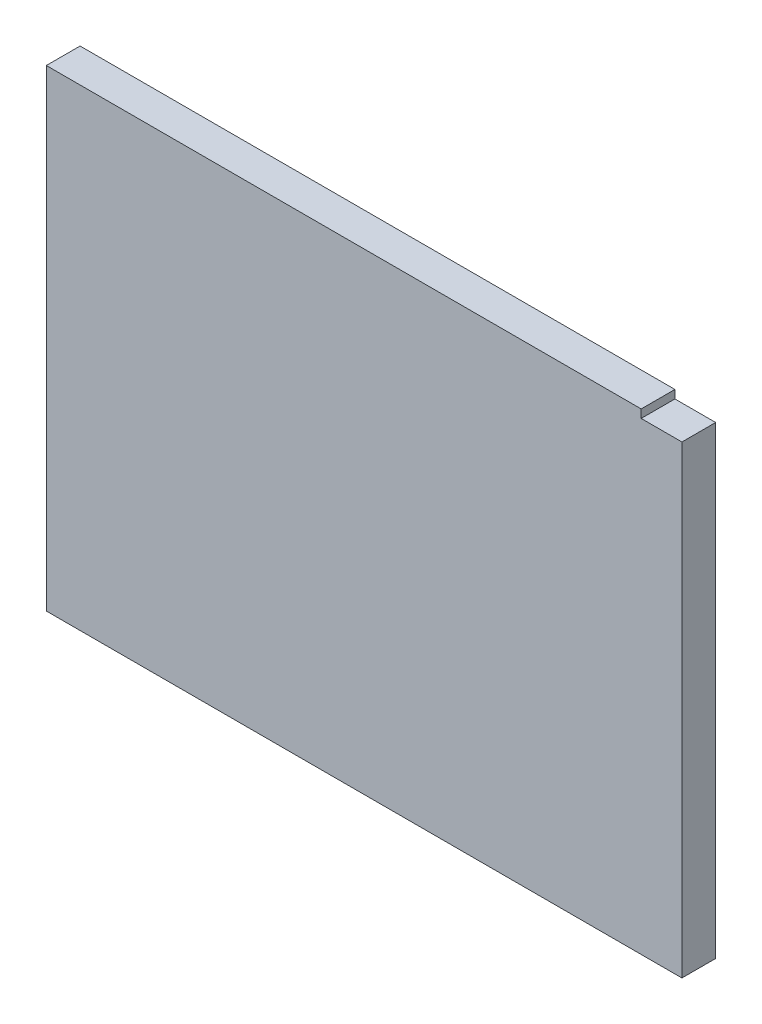
ISO-10303-21;
HEADER;
FILE_DESCRIPTION(('STEP AP214'),'2;1');
FILE_NAME('part.step','',(''),(''),'','','');
FILE_SCHEMA(('AUTOMOTIVE_DESIGN { 1 0 10303 214 1 1 1 1 }'));
ENDSEC;
DATA;
#1=APPLICATION_CONTEXT('core data for automotive mechanical design processes');
#2=APPLICATION_PROTOCOL_DEFINITION('international standard','automotive_design',2000,#1);
#3=PRODUCT_CONTEXT('',#1,'mechanical');
#4=PRODUCT('Part','Part','',(#3));
#5=PRODUCT_RELATED_PRODUCT_CATEGORY('part','',(#4));
#6=PRODUCT_DEFINITION_FORMATION('','',#4);
#7=PRODUCT_DEFINITION_CONTEXT('part definition',#1,'design');
#8=PRODUCT_DEFINITION('design','',#6,#7);
#9=PRODUCT_DEFINITION_SHAPE('','',#8);
#10=(LENGTH_UNIT() NAMED_UNIT(*) SI_UNIT(.MILLI.,.METRE.));
#11=(NAMED_UNIT(*) PLANE_ANGLE_UNIT() SI_UNIT($,.RADIAN.));
#12=(NAMED_UNIT(*) SI_UNIT($,.STERADIAN.) SOLID_ANGLE_UNIT());
#13=UNCERTAINTY_MEASURE_WITH_UNIT(LENGTH_MEASURE(1.E-05),#10,'distance_accuracy_value','');
#14=(GEOMETRIC_REPRESENTATION_CONTEXT(3) GLOBAL_UNCERTAINTY_ASSIGNED_CONTEXT((#13)) GLOBAL_UNIT_ASSIGNED_CONTEXT((#10,
#11,#12)) REPRESENTATION_CONTEXT('',''));
#15=CARTESIAN_POINT('',(0.,0.,0.));
#16=DIRECTION('',(0.,0.,1.));
#17=DIRECTION('',(1.,0.,0.));
#18=AXIS2_PLACEMENT_3D('',#15,#16,#17);
#19=CARTESIAN_POINT('',(-4978.4,1379.22,-11.43));
#20=DIRECTION('',(0.,1.,0.));
#21=DIRECTION('',(0.,0.,1.));
#22=AXIS2_PLACEMENT_3D('',#19,#20,#21);
#23=PLANE('',#22);
#24=DIRECTION('',(0.,0.,-1.));
#25=VECTOR('',#24,1.);
#26=CARTESIAN_POINT('',(-4776.93355,1379.22,14.0785801167062));
#27=LINE('',#26,#25);
#28=CARTESIAN_POINT('',(-4776.93355,1379.22,0.));
#29=VERTEX_POINT('',#28);
#30=CARTESIAN_POINT('',(-4776.93355,1379.22,-11.43));
#31=VERTEX_POINT('',#30);
#32=EDGE_CURVE('E47',#29,#31,#27,.T.);
#33=ORIENTED_EDGE('',*,*,#32,.T.);
#34=DIRECTION('',(-1.,0.,0.));
#35=VECTOR('',#34,1.);
#36=CARTESIAN_POINT('',(-4978.4,1379.22,-11.43));
#37=LINE('',#36,#35);
#38=CARTESIAN_POINT('',(-4978.4,1379.22,-11.43));
#39=VERTEX_POINT('',#38);
#40=EDGE_CURVE('E75',#31,#39,#37,.T.);
#41=ORIENTED_EDGE('',*,*,#40,.T.);
#42=DIRECTION('',(0.,0.,1.));
#43=VECTOR('',#42,1.);
#44=CARTESIAN_POINT('',(-4978.4,1379.22,-11.43));
#45=LINE('',#44,#43);
#46=CARTESIAN_POINT('',(-4978.4,1379.22,0.));
#47=VERTEX_POINT('',#46);
#48=EDGE_CURVE('E34',#39,#47,#45,.T.);
#49=ORIENTED_EDGE('',*,*,#48,.T.);
#50=DIRECTION('',(-1.,0.,0.));
#51=VECTOR('',#50,1.);
#52=CARTESIAN_POINT('',(-4978.4,1379.22,0.));
#53=LINE('',#52,#51);
#54=EDGE_CURVE('E116',#29,#47,#53,.T.);
#55=ORIENTED_EDGE('',*,*,#54,.F.);
#56=EDGE_LOOP('',(#33,#41,#49,#55));
#57=FACE_BOUND('',#56,.T.);
#58=ADVANCED_FACE('F31',(#57),#23,.T.);
#59=CARTESIAN_POINT('',(-4763.135,1379.22,-11.43));
#60=DIRECTION('',(1.,0.,0.));
#61=DIRECTION('',(0.,0.,-1.));
#62=AXIS2_PLACEMENT_3D('',#59,#60,#61);
#63=PLANE('',#62);
#64=DIRECTION('',(0.,0.,-1.));
#65=VECTOR('',#64,1.);
#66=CARTESIAN_POINT('',(-4763.135,1376.426,14.0785801167062));
#67=LINE('',#66,#65);
#68=CARTESIAN_POINT('',(-4763.135,1376.426,0.));
#69=VERTEX_POINT('',#68);
#70=CARTESIAN_POINT('',(-4763.135,1376.426,-11.43));
#71=VERTEX_POINT('',#70);
#72=EDGE_CURVE('E103',#69,#71,#67,.T.);
#73=ORIENTED_EDGE('',*,*,#72,.F.);
#74=DIRECTION('',(0.,1.,0.));
#75=VECTOR('',#74,1.);
#76=CARTESIAN_POINT('',(-4763.135,1379.22,0.));
#77=LINE('',#76,#75);
#78=CARTESIAN_POINT('',(-4763.135,1219.2,0.));
#79=VERTEX_POINT('',#78);
#80=EDGE_CURVE('E119',#79,#69,#77,.T.);
#81=ORIENTED_EDGE('',*,*,#80,.F.);
#82=DIRECTION('',(0.,0.,1.));
#83=VECTOR('',#82,1.);
#84=CARTESIAN_POINT('',(-4763.135,1219.2,-11.43));
#85=LINE('',#84,#83);
#86=CARTESIAN_POINT('',(-4763.135,1219.2,-11.43));
#87=VERTEX_POINT('',#86);
#88=EDGE_CURVE('E11',#87,#79,#85,.T.);
#89=ORIENTED_EDGE('',*,*,#88,.F.);
#90=DIRECTION('',(0.,1.,0.));
#91=VECTOR('',#90,1.);
#92=CARTESIAN_POINT('',(-4763.135,1379.22,-11.43));
#93=LINE('',#92,#91);
#94=EDGE_CURVE('E124',#87,#71,#93,.T.);
#95=ORIENTED_EDGE('',*,*,#94,.T.);
#96=EDGE_LOOP('',(#73,#81,#89,#95));
#97=FACE_BOUND('',#96,.T.);
#98=ADVANCED_FACE('F139',(#97),#63,.T.);
#99=CARTESIAN_POINT('',(-4763.135,1219.2,-11.43));
#100=DIRECTION('',(0.,-1.,0.));
#101=DIRECTION('',(1.,0.,0.));
#102=AXIS2_PLACEMENT_3D('',#99,#100,#101);
#103=PLANE('',#102);
#104=DIRECTION('',(1.,0.,0.));
#105=VECTOR('',#104,1.);
#106=CARTESIAN_POINT('',(-4763.135,1219.2,0.));
#107=LINE('',#106,#105);
#108=CARTESIAN_POINT('',(-4978.4,1219.2,0.));
#109=VERTEX_POINT('',#108);
#110=EDGE_CURVE('E130',#109,#79,#107,.T.);
#111=ORIENTED_EDGE('',*,*,#110,.F.);
#112=DIRECTION('',(0.,0.,1.));
#113=VECTOR('',#112,1.);
#114=CARTESIAN_POINT('',(-4978.4,1219.2,-11.43));
#115=LINE('',#114,#113);
#116=CARTESIAN_POINT('',(-4978.4,1219.2,-11.43));
#117=VERTEX_POINT('',#116);
#118=EDGE_CURVE('E39',#117,#109,#115,.T.);
#119=ORIENTED_EDGE('',*,*,#118,.F.);
#120=DIRECTION('',(1.,0.,0.));
#121=VECTOR('',#120,1.);
#122=CARTESIAN_POINT('',(-4763.135,1219.2,-11.43));
#123=LINE('',#122,#121);
#124=EDGE_CURVE('E122',#117,#87,#123,.T.);
#125=ORIENTED_EDGE('',*,*,#124,.T.);
#126=ORIENTED_EDGE('',*,*,#88,.T.);
#127=EDGE_LOOP('',(#111,#119,#125,#126));
#128=FACE_BOUND('',#127,.T.);
#129=ADVANCED_FACE('F141',(#128),#103,.T.);
#130=CARTESIAN_POINT('',(-4978.4,1219.2,-11.43));
#131=DIRECTION('',(-1.,0.,0.));
#132=DIRECTION('',(0.,0.,1.));
#133=AXIS2_PLACEMENT_3D('',#130,#131,#132);
#134=PLANE('',#133);
#135=DIRECTION('',(0.,-1.,0.));
#136=VECTOR('',#135,1.);
#137=CARTESIAN_POINT('',(-4978.4,1219.2,0.));
#138=LINE('',#137,#136);
#139=EDGE_CURVE('E127',#47,#109,#138,.T.);
#140=ORIENTED_EDGE('',*,*,#139,.F.);
#141=ORIENTED_EDGE('',*,*,#48,.F.);
#142=DIRECTION('',(0.,-1.,0.));
#143=VECTOR('',#142,1.);
#144=CARTESIAN_POINT('',(-4978.4,1219.2,-11.43));
#145=LINE('',#144,#143);
#146=EDGE_CURVE('E118',#39,#117,#145,.T.);
#147=ORIENTED_EDGE('',*,*,#146,.T.);
#148=ORIENTED_EDGE('',*,*,#118,.T.);
#149=EDGE_LOOP('',(#140,#141,#147,#148));
#150=FACE_BOUND('',#149,.T.);
#151=ADVANCED_FACE('F136',(#150),#134,.T.);
#152=CARTESIAN_POINT('',(-4763.135,1379.22,-11.43));
#153=DIRECTION('',(0.,0.,-1.));
#154=DIRECTION('',(-1.,0.,0.));
#155=AXIS2_PLACEMENT_3D('',#152,#153,#154);
#156=PLANE('',#155);
#157=DIRECTION('',(-1.,0.,0.));
#158=VECTOR('',#157,1.);
#159=CARTESIAN_POINT('',(-4763.135,1376.426,-11.43));
#160=LINE('',#159,#158);
#161=CARTESIAN_POINT('',(-4776.93355,1376.426,-11.43));
#162=VERTEX_POINT('',#161);
#163=EDGE_CURVE('E100',#71,#162,#160,.T.);
#164=ORIENTED_EDGE('',*,*,#163,.F.);
#165=ORIENTED_EDGE('',*,*,#94,.F.);
#166=ORIENTED_EDGE('',*,*,#124,.F.);
#167=ORIENTED_EDGE('',*,*,#146,.F.);
#168=ORIENTED_EDGE('',*,*,#40,.F.);
#169=DIRECTION('',(0.,1.,0.));
#170=VECTOR('',#169,1.);
#171=CARTESIAN_POINT('',(-4776.93355,1376.426,-11.43));
#172=LINE('',#171,#170);
#173=EDGE_CURVE('E94',#162,#31,#172,.T.);
#174=ORIENTED_EDGE('',*,*,#173,.F.);
#175=EDGE_LOOP('',(#164,#165,#166,#167,#168,#174));
#176=FACE_BOUND('',#175,.T.);
#177=ADVANCED_FACE('F107',(#176),#156,.T.);
#178=CARTESIAN_POINT('',(-4763.135,1379.22,0.));
#179=DIRECTION('',(0.,0.,-1.));
#180=DIRECTION('',(-1.,0.,0.));
#181=AXIS2_PLACEMENT_3D('',#178,#179,#180);
#182=PLANE('',#181);
#183=ORIENTED_EDGE('',*,*,#80,.T.);
#184=DIRECTION('',(1.,0.,0.));
#185=VECTOR('',#184,1.);
#186=CARTESIAN_POINT('',(-4763.135,1376.426,0.));
#187=LINE('',#186,#185);
#188=CARTESIAN_POINT('',(-4776.93355,1376.426,0.));
#189=VERTEX_POINT('',#188);
#190=EDGE_CURVE('E113',#189,#69,#187,.T.);
#191=ORIENTED_EDGE('',*,*,#190,.F.);
#192=DIRECTION('',(0.,-1.,0.));
#193=VECTOR('',#192,1.);
#194=CARTESIAN_POINT('',(-4776.93355,1376.426,0.));
#195=LINE('',#194,#193);
#196=EDGE_CURVE('E95',#29,#189,#195,.T.);
#197=ORIENTED_EDGE('',*,*,#196,.F.);
#198=ORIENTED_EDGE('',*,*,#54,.T.);
#199=ORIENTED_EDGE('',*,*,#139,.T.);
#200=ORIENTED_EDGE('',*,*,#110,.T.);
#201=EDGE_LOOP('',(#183,#191,#197,#198,#199,#200));
#202=FACE_BOUND('',#201,.T.);
#203=ADVANCED_FACE('F138',(#202),#182,.F.);
#204=CARTESIAN_POINT('',(-4763.135,1376.426,14.0785801167062));
#205=DIRECTION('',(0.,-1.,0.));
#206=DIRECTION('',(0.,0.,-1.));
#207=AXIS2_PLACEMENT_3D('',#204,#205,#206);
#208=PLANE('',#207);
#209=ORIENTED_EDGE('',*,*,#190,.T.);
#210=ORIENTED_EDGE('',*,*,#72,.T.);
#211=ORIENTED_EDGE('',*,*,#163,.T.);
#212=DIRECTION('',(0.,0.,-1.));
#213=VECTOR('',#212,1.);
#214=CARTESIAN_POINT('',(-4776.93355,1376.426,14.0785801167062));
#215=LINE('',#214,#213);
#216=EDGE_CURVE('E90',#189,#162,#215,.T.);
#217=ORIENTED_EDGE('',*,*,#216,.F.);
#218=EDGE_LOOP('',(#209,#210,#211,#217));
#219=FACE_BOUND('',#218,.T.);
#220=ADVANCED_FACE('F101',(#219),#208,.F.);
#221=CARTESIAN_POINT('',(-4776.93355,1376.426,14.0785801167062));
#222=DIRECTION('',(-1.,0.,0.));
#223=DIRECTION('',(0.,0.,1.));
#224=AXIS2_PLACEMENT_3D('',#221,#222,#223);
#225=PLANE('',#224);
#226=ORIENTED_EDGE('',*,*,#196,.T.);
#227=ORIENTED_EDGE('',*,*,#216,.T.);
#228=ORIENTED_EDGE('',*,*,#173,.T.);
#229=ORIENTED_EDGE('',*,*,#32,.F.);
#230=EDGE_LOOP('',(#226,#227,#228,#229));
#231=FACE_BOUND('',#230,.T.);
#232=ADVANCED_FACE('F92',(#231),#225,.F.);
#233=CLOSED_SHELL('',(#58,#98,#129,#151,#177,#203,#220,#232));
#234=MANIFOLD_SOLID_BREP('B2',#233);
#235=ADVANCED_BREP_SHAPE_REPRESENTATION('',(#18,#234),#14);
#236=SHAPE_DEFINITION_REPRESENTATION(#9,#235);
ENDSEC;
END-ISO-10303-21;
